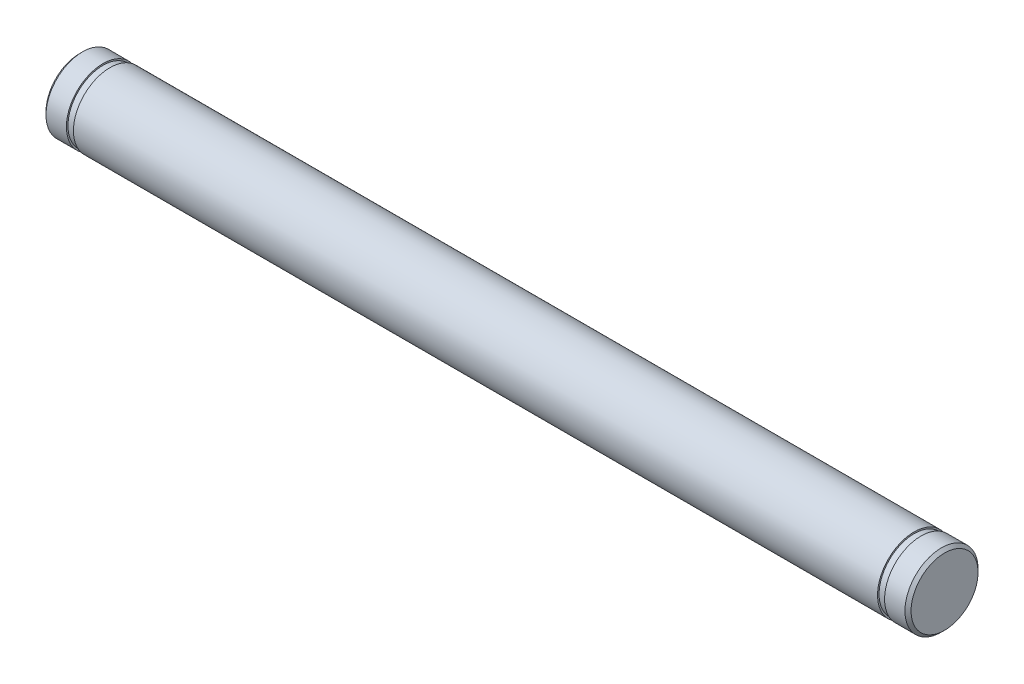
ISO-10303-21;
HEADER;
FILE_DESCRIPTION(('STEP AP214'),'2;1');
FILE_NAME('part.step','',(''),(''),'','','');
FILE_SCHEMA(('AUTOMOTIVE_DESIGN { 1 0 10303 214 1 1 1 1 }'));
ENDSEC;
DATA;
#1=APPLICATION_CONTEXT('core data for automotive mechanical design processes');
#2=APPLICATION_PROTOCOL_DEFINITION('international standard','automotive_design',2000,#1);
#3=PRODUCT_CONTEXT('',#1,'mechanical');
#4=PRODUCT('Part','Part','',(#3));
#5=PRODUCT_RELATED_PRODUCT_CATEGORY('part','',(#4));
#6=PRODUCT_DEFINITION_FORMATION('','',#4);
#7=PRODUCT_DEFINITION_CONTEXT('part definition',#1,'design');
#8=PRODUCT_DEFINITION('design','',#6,#7);
#9=PRODUCT_DEFINITION_SHAPE('','',#8);
#10=(LENGTH_UNIT() NAMED_UNIT(*) SI_UNIT(.MILLI.,.METRE.));
#11=(NAMED_UNIT(*) PLANE_ANGLE_UNIT() SI_UNIT($,.RADIAN.));
#12=(NAMED_UNIT(*) SI_UNIT($,.STERADIAN.) SOLID_ANGLE_UNIT());
#13=UNCERTAINTY_MEASURE_WITH_UNIT(LENGTH_MEASURE(1.E-05),#10,'distance_accuracy_value','');
#14=(GEOMETRIC_REPRESENTATION_CONTEXT(3) GLOBAL_UNCERTAINTY_ASSIGNED_CONTEXT((#13)) GLOBAL_UNIT_ASSIGNED_CONTEXT((#10,
#11,#12)) REPRESENTATION_CONTEXT('',''));
#15=CARTESIAN_POINT('',(0.,0.,0.));
#16=DIRECTION('',(0.,0.,1.));
#17=DIRECTION('',(1.,0.,0.));
#18=AXIS2_PLACEMENT_3D('',#15,#16,#17);
#19=CARTESIAN_POINT('',(142.,0.,0.));
#20=DIRECTION('',(-1.,0.,0.));
#21=DIRECTION('',(0.,0.,1.));
#22=AXIS2_PLACEMENT_3D('',#19,#20,#21);
#23=CYLINDRICAL_SURFACE('',#22,6.);
#24=CARTESIAN_POINT('',(5.,0.,0.));
#25=DIRECTION('',(1.,0.,0.));
#26=DIRECTION('',(0.,0.,-1.));
#27=AXIS2_PLACEMENT_3D('',#24,#25,#26);
#28=CIRCLE('',#27,6.);
#29=CARTESIAN_POINT('',(5.,0.,-6.));
#30=VERTEX_POINT('',#29);
#31=EDGE_CURVE('E48',#30,#30,#28,.T.);
#32=ORIENTED_EDGE('',*,*,#31,.T.);
#33=EDGE_LOOP('',(#32));
#34=FACE_BOUND('',#33,.T.);
#35=CARTESIAN_POINT('',(137.,0.,0.));
#36=DIRECTION('',(1.,0.,0.));
#37=DIRECTION('',(0.,0.,-1.));
#38=AXIS2_PLACEMENT_3D('',#35,#36,#37);
#39=CIRCLE('',#38,6.);
#40=CARTESIAN_POINT('',(137.,0.,-6.));
#41=VERTEX_POINT('',#40);
#42=EDGE_CURVE('E55',#41,#41,#39,.T.);
#43=ORIENTED_EDGE('',*,*,#42,.F.);
#44=EDGE_LOOP('',(#43));
#45=FACE_BOUND('',#44,.T.);
#46=ADVANCED_FACE('F31',(#34,#45),#23,.T.);
#47=CARTESIAN_POINT('',(0.5,0.,0.));
#48=DIRECTION('',(-1.,0.,0.));
#49=DIRECTION('',(0.,0.,1.));
#50=AXIS2_PLACEMENT_3D('',#47,#48,#49);
#51=CIRCLE('',#50,6.);
#52=CARTESIAN_POINT('',(0.5,0.,6.));
#53=VERTEX_POINT('',#52);
#54=EDGE_CURVE('E39',#53,#53,#51,.T.);
#55=ORIENTED_EDGE('',*,*,#54,.F.);
#56=EDGE_LOOP('',(#55));
#57=FACE_BOUND('',#56,.T.);
#58=CARTESIAN_POINT('',(3.84999999999999,0.,0.));
#59=DIRECTION('',(1.,0.,0.));
#60=DIRECTION('',(0.,0.,-1.));
#61=AXIS2_PLACEMENT_3D('',#58,#59,#60);
#62=CIRCLE('',#61,6.);
#63=CARTESIAN_POINT('',(3.84999999999999,0.,-6.));
#64=VERTEX_POINT('',#63);
#65=EDGE_CURVE('E51',#64,#64,#62,.T.);
#66=ORIENTED_EDGE('',*,*,#65,.F.);
#67=EDGE_LOOP('',(#66));
#68=FACE_BOUND('',#67,.T.);
#69=ADVANCED_FACE('F98',(#57,#68),#23,.T.);
#70=CARTESIAN_POINT('',(0.,0.,0.));
#71=DIRECTION('',(1.,0.,0.));
#72=DIRECTION('',(0.,0.,-1.));
#73=AXIS2_PLACEMENT_3D('',#70,#71,#72);
#74=PLANE('',#73);
#75=CARTESIAN_POINT('',(0.,0.,0.));
#76=DIRECTION('',(-1.,0.,0.));
#77=DIRECTION('',(0.,0.,1.));
#78=AXIS2_PLACEMENT_3D('',#75,#76,#77);
#79=CIRCLE('',#78,5.5);
#80=CARTESIAN_POINT('',(0.,0.,5.5));
#81=VERTEX_POINT('',#80);
#82=EDGE_CURVE('E10',#81,#81,#79,.T.);
#83=ORIENTED_EDGE('',*,*,#82,.T.);
#84=EDGE_LOOP('',(#83));
#85=FACE_BOUND('',#84,.T.);
#86=ADVANCED_FACE('F33',(#85),#74,.F.);
#87=CARTESIAN_POINT('',(0.5,0.,0.));
#88=DIRECTION('',(1.,0.,0.));
#89=DIRECTION('',(0.,0.,-1.));
#90=AXIS2_PLACEMENT_3D('',#87,#88,#89);
#91=CONICAL_SURFACE('',#90,6.,0.785398163397448);
#92=ORIENTED_EDGE('',*,*,#82,.F.);
#93=EDGE_LOOP('',(#92));
#94=FACE_BOUND('',#93,.T.);
#95=ORIENTED_EDGE('',*,*,#54,.T.);
#96=EDGE_LOOP('',(#95));
#97=FACE_BOUND('',#96,.T.);
#98=ADVANCED_FACE('F128',(#94,#97),#91,.T.);
#99=CARTESIAN_POINT('',(3.85,0.,0.));
#100=DIRECTION('',(1.,0.,0.));
#101=DIRECTION('',(0.,0.,-1.));
#102=AXIS2_PLACEMENT_3D('',#99,#100,#101);
#103=PLANE('',#102);
#104=CARTESIAN_POINT('',(3.85,0.,0.));
#105=DIRECTION('',(1.,0.,0.));
#106=DIRECTION('',(0.,0.,-1.));
#107=AXIS2_PLACEMENT_3D('',#104,#105,#106);
#108=CIRCLE('',#107,5.75);
#109=CARTESIAN_POINT('',(3.85,0.,-5.75));
#110=VERTEX_POINT('',#109);
#111=EDGE_CURVE('E52',#110,#110,#108,.T.);
#112=ORIENTED_EDGE('',*,*,#111,.F.);
#113=EDGE_LOOP('',(#112));
#114=FACE_BOUND('',#113,.T.);
#115=ORIENTED_EDGE('',*,*,#65,.T.);
#116=EDGE_LOOP('',(#115));
#117=FACE_BOUND('',#116,.T.);
#118=ADVANCED_FACE('F126',(#114,#117),#103,.T.);
#119=CARTESIAN_POINT('',(5.,0.,0.));
#120=DIRECTION('',(1.,0.,0.));
#121=DIRECTION('',(0.,0.,-1.));
#122=AXIS2_PLACEMENT_3D('',#119,#120,#121);
#123=PLANE('',#122);
#124=CARTESIAN_POINT('',(5.,0.,0.));
#125=DIRECTION('',(1.,0.,0.));
#126=DIRECTION('',(0.,0.,-1.));
#127=AXIS2_PLACEMENT_3D('',#124,#125,#126);
#128=CIRCLE('',#127,5.75);
#129=CARTESIAN_POINT('',(5.,0.,-5.75));
#130=VERTEX_POINT('',#129);
#131=EDGE_CURVE('E61',#130,#130,#128,.T.);
#132=ORIENTED_EDGE('',*,*,#131,.T.);
#133=EDGE_LOOP('',(#132));
#134=FACE_BOUND('',#133,.T.);
#135=ORIENTED_EDGE('',*,*,#31,.F.);
#136=EDGE_LOOP('',(#135));
#137=FACE_BOUND('',#136,.T.);
#138=ADVANCED_FACE('F122',(#134,#137),#123,.F.);
#139=CARTESIAN_POINT('',(3.85,0.,0.));
#140=DIRECTION('',(1.,0.,0.));
#141=DIRECTION('',(0.,0.,-1.));
#142=AXIS2_PLACEMENT_3D('',#139,#140,#141);
#143=CYLINDRICAL_SURFACE('',#142,5.75);
#144=ORIENTED_EDGE('',*,*,#111,.T.);
#145=EDGE_LOOP('',(#144));
#146=FACE_BOUND('',#145,.T.);
#147=ORIENTED_EDGE('',*,*,#131,.F.);
#148=EDGE_LOOP('',(#147));
#149=FACE_BOUND('',#148,.T.);
#150=ADVANCED_FACE('F114',(#146,#149),#143,.T.);
#151=CARTESIAN_POINT('',(138.15,0.,0.));
#152=DIRECTION('',(1.,0.,0.));
#153=DIRECTION('',(0.,0.,-1.));
#154=AXIS2_PLACEMENT_3D('',#151,#152,#153);
#155=PLANE('',#154);
#156=CARTESIAN_POINT('',(138.15,0.,0.));
#157=DIRECTION('',(1.,0.,0.));
#158=DIRECTION('',(0.,0.,-1.));
#159=AXIS2_PLACEMENT_3D('',#156,#157,#158);
#160=CIRCLE('',#159,5.75);
#161=CARTESIAN_POINT('',(138.15,0.,-5.75));
#162=VERTEX_POINT('',#161);
#163=EDGE_CURVE('E57',#162,#162,#160,.T.);
#164=ORIENTED_EDGE('',*,*,#163,.T.);
#165=EDGE_LOOP('',(#164));
#166=FACE_BOUND('',#165,.T.);
#167=CARTESIAN_POINT('',(138.15,0.,0.));
#168=DIRECTION('',(1.,0.,0.));
#169=DIRECTION('',(0.,0.,-1.));
#170=AXIS2_PLACEMENT_3D('',#167,#168,#169);
#171=CIRCLE('',#170,6.);
#172=CARTESIAN_POINT('',(138.15,0.,-6.));
#173=VERTEX_POINT('',#172);
#174=EDGE_CURVE('E35',#173,#173,#171,.T.);
#175=ORIENTED_EDGE('',*,*,#174,.F.);
#176=EDGE_LOOP('',(#175));
#177=FACE_BOUND('',#176,.T.);
#178=ADVANCED_FACE('F112',(#166,#177),#155,.F.);
#179=CARTESIAN_POINT('',(137.,0.,0.));
#180=DIRECTION('',(1.,0.,0.));
#181=DIRECTION('',(0.,0.,-1.));
#182=AXIS2_PLACEMENT_3D('',#179,#180,#181);
#183=PLANE('',#182);
#184=CARTESIAN_POINT('',(137.,0.,0.));
#185=DIRECTION('',(1.,0.,0.));
#186=DIRECTION('',(0.,0.,-1.));
#187=AXIS2_PLACEMENT_3D('',#184,#185,#186);
#188=CIRCLE('',#187,5.75);
#189=CARTESIAN_POINT('',(137.,0.,-5.75));
#190=VERTEX_POINT('',#189);
#191=EDGE_CURVE('E63',#190,#190,#188,.T.);
#192=ORIENTED_EDGE('',*,*,#191,.F.);
#193=EDGE_LOOP('',(#192));
#194=FACE_BOUND('',#193,.T.);
#195=ORIENTED_EDGE('',*,*,#42,.T.);
#196=EDGE_LOOP('',(#195));
#197=FACE_BOUND('',#196,.T.);
#198=ADVANCED_FACE('F93',(#194,#197),#183,.T.);
#199=CARTESIAN_POINT('',(138.15,0.,0.));
#200=DIRECTION('',(-1.,0.,0.));
#201=DIRECTION('',(0.,0.,1.));
#202=AXIS2_PLACEMENT_3D('',#199,#200,#201);
#203=CYLINDRICAL_SURFACE('',#202,5.75);
#204=ORIENTED_EDGE('',*,*,#163,.F.);
#205=EDGE_LOOP('',(#204));
#206=FACE_BOUND('',#205,.T.);
#207=ORIENTED_EDGE('',*,*,#191,.T.);
#208=EDGE_LOOP('',(#207));
#209=FACE_BOUND('',#208,.T.);
#210=ADVANCED_FACE('F88',(#206,#209),#203,.T.);
#211=CARTESIAN_POINT('',(142.,5.5,0.));
#212=DIRECTION('',(-1.,0.,0.));
#213=DIRECTION('',(0.,0.,1.));
#214=AXIS2_PLACEMENT_3D('',#211,#212,#213);
#215=PLANE('',#214);
#216=CARTESIAN_POINT('',(142.,0.,0.));
#217=DIRECTION('',(-1.,0.,0.));
#218=DIRECTION('',(0.,0.,1.));
#219=AXIS2_PLACEMENT_3D('',#216,#217,#218);
#220=CIRCLE('',#219,5.5);
#221=CARTESIAN_POINT('',(142.,0.,5.5));
#222=VERTEX_POINT('',#221);
#223=EDGE_CURVE('E54',#222,#222,#220,.T.);
#224=ORIENTED_EDGE('',*,*,#223,.F.);
#225=EDGE_LOOP('',(#224));
#226=FACE_BOUND('',#225,.T.);
#227=ADVANCED_FACE('F83',(#226),#215,.F.);
#228=CARTESIAN_POINT('',(142.,0.,0.));
#229=DIRECTION('',(-1.,0.,0.));
#230=DIRECTION('',(0.,0.,1.));
#231=AXIS2_PLACEMENT_3D('',#228,#229,#230);
#232=CONICAL_SURFACE('',#231,5.5,0.785398163397448);
#233=CARTESIAN_POINT('',(141.5,0.,0.));
#234=DIRECTION('',(-1.,0.,0.));
#235=DIRECTION('',(0.,0.,1.));
#236=AXIS2_PLACEMENT_3D('',#233,#234,#235);
#237=CIRCLE('',#236,6.);
#238=CARTESIAN_POINT('',(141.5,0.,6.));
#239=VERTEX_POINT('',#238);
#240=EDGE_CURVE('E44',#239,#239,#237,.T.);
#241=ORIENTED_EDGE('',*,*,#240,.F.);
#242=EDGE_LOOP('',(#241));
#243=FACE_BOUND('',#242,.T.);
#244=ORIENTED_EDGE('',*,*,#223,.T.);
#245=EDGE_LOOP('',(#244));
#246=FACE_BOUND('',#245,.T.);
#247=ADVANCED_FACE('F80',(#243,#246),#232,.T.);
#248=ORIENTED_EDGE('',*,*,#174,.T.);
#249=EDGE_LOOP('',(#248));
#250=FACE_BOUND('',#249,.T.);
#251=ORIENTED_EDGE('',*,*,#240,.T.);
#252=EDGE_LOOP('',(#251));
#253=FACE_BOUND('',#252,.T.);
#254=ADVANCED_FACE('F78',(#250,#253),#23,.T.);
#255=CLOSED_SHELL('',(#46,#69,#86,#98,#118,#138,#150,#178,#198,#210,#227,#247,#254));
#256=MANIFOLD_SOLID_BREP('B2',#255);
#257=ADVANCED_BREP_SHAPE_REPRESENTATION('',(#18,#256),#14);
#258=SHAPE_DEFINITION_REPRESENTATION(#9,#257);
ENDSEC;
END-ISO-10303-21;
